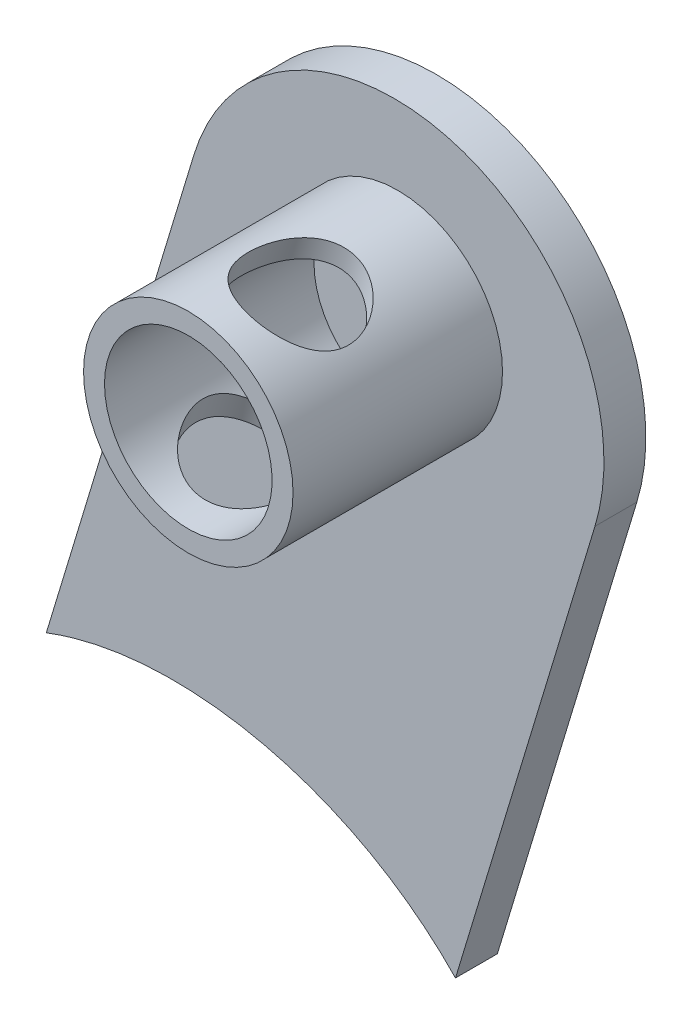
ISO-10303-21;
HEADER;
FILE_DESCRIPTION(('STEP AP214'),'2;1');
FILE_NAME('part.step','',(''),(''),'','','');
FILE_SCHEMA(('AUTOMOTIVE_DESIGN { 1 0 10303 214 1 1 1 1 }'));
ENDSEC;
DATA;
#1=APPLICATION_CONTEXT('core data for automotive mechanical design processes');
#2=APPLICATION_PROTOCOL_DEFINITION('international standard','automotive_design',2000,#1);
#3=PRODUCT_CONTEXT('',#1,'mechanical');
#4=PRODUCT('Part','Part','',(#3));
#5=PRODUCT_RELATED_PRODUCT_CATEGORY('part','',(#4));
#6=PRODUCT_DEFINITION_FORMATION('','',#4);
#7=PRODUCT_DEFINITION_CONTEXT('part definition',#1,'design');
#8=PRODUCT_DEFINITION('design','',#6,#7);
#9=PRODUCT_DEFINITION_SHAPE('','',#8);
#10=(LENGTH_UNIT() NAMED_UNIT(*) SI_UNIT(.MILLI.,.METRE.));
#11=(NAMED_UNIT(*) PLANE_ANGLE_UNIT() SI_UNIT($,.RADIAN.));
#12=(NAMED_UNIT(*) SI_UNIT($,.STERADIAN.) SOLID_ANGLE_UNIT());
#13=UNCERTAINTY_MEASURE_WITH_UNIT(LENGTH_MEASURE(1.E-05),#10,'distance_accuracy_value','');
#14=(GEOMETRIC_REPRESENTATION_CONTEXT(3) GLOBAL_UNCERTAINTY_ASSIGNED_CONTEXT((#13)) GLOBAL_UNIT_ASSIGNED_CONTEXT((#10,
#11,#12)) REPRESENTATION_CONTEXT('',''));
#15=CARTESIAN_POINT('',(0.,0.,0.));
#16=DIRECTION('',(0.,0.,1.));
#17=DIRECTION('',(1.,0.,0.));
#18=AXIS2_PLACEMENT_3D('',#15,#16,#17);
#19=CARTESIAN_POINT('',(1209.34523860419,-251.377000383089,-615.999346088971));
#20=CARTESIAN_POINT('',(1202.97437345163,-275.551616764902,-615.999346088971));
#21=CARTESIAN_POINT('',(1233.28038668328,-283.53832152006,-615.999346088971));
#22=CARTESIAN_POINT('',(1239.65125183585,-259.363705138247,-615.999346088971));
#23=CARTESIAN_POINT('',(1246.02211698841,-235.189088756434,-615.999346088971));
#24=CARTESIAN_POINT('',(1215.71610375676,-227.202384001276,-615.999346088971));
#25=CARTESIAN_POINT('',(1209.34523860419,-251.377000383089,-615.999346088971));
#26=(BOUNDED_CURVE() B_SPLINE_CURVE(3,(#19,#20,#21,#22,#23,#24,#25),.UNSPECIFIED.,.T.,
.F.) B_SPLINE_CURVE_WITH_KNOTS((4,3,4),(0.,0.5,1.),
.UNSPECIFIED.) CURVE() GEOMETRIC_REPRESENTATION_ITEM() RATIONAL_B_SPLINE_CURVE((1.,
0.333333333333333,0.333333333333333,1.,0.333333333333333,0.333333333333333,1.)) REPRESENTATION_ITEM(''));
#27=DIRECTION('',(0.,0.,-1.));
#28=VECTOR('',#27,1.);
#29=SURFACE_OF_LINEAR_EXTRUSION('',#26,#28);
#30=CARTESIAN_POINT('',(1209.34523860419,-251.377000383089,-617.999346088971));
#31=CARTESIAN_POINT('',(1202.97437345163,-275.551616764902,-617.999346088971));
#32=CARTESIAN_POINT('',(1233.28038668328,-283.53832152006,-617.999346088971));
#33=CARTESIAN_POINT('',(1239.65125183585,-259.363705138247,-617.999346088971));
#34=CARTESIAN_POINT('',(1246.02211698841,-235.189088756434,-617.999346088971));
#35=CARTESIAN_POINT('',(1215.71610375676,-227.202384001276,-617.999346088971));
#36=CARTESIAN_POINT('',(1209.34523860419,-251.377000383089,-617.999346088971));
#37=(BOUNDED_CURVE() B_SPLINE_CURVE(3,(#30,#31,#32,#33,#34,#35,#36),.UNSPECIFIED.,.T.,
.F.) B_SPLINE_CURVE_WITH_KNOTS((4,3,4),(0.,0.5,1.),
.UNSPECIFIED.) CURVE() GEOMETRIC_REPRESENTATION_ITEM() RATIONAL_B_SPLINE_CURVE((1.,
0.333333333333333,0.333333333333333,1.,0.333333333333333,0.333333333333333,1.)) REPRESENTATION_ITEM(''));
#38=CARTESIAN_POINT('',(1236.2588408996,-248.221098890482,-617.999346088971));
#39=VERTEX_POINT('',#38);
#40=CARTESIAN_POINT('',(1216.72659095181,-243.715486457987,-617.999346088971));
#41=VERTEX_POINT('',#40);
#42=EDGE_CURVE('E114',#39,#41,#37,.T.);
#43=ORIENTED_EDGE('',*,*,#42,.F.);
#44=DIRECTION('',(0.,0.,-1.));
#45=VECTOR('',#44,1.);
#46=CARTESIAN_POINT('',(1236.2588408996,-248.221098890482,-615.999346088971));
#47=LINE('',#46,#45);
#48=CARTESIAN_POINT('',(1236.2588408996,-248.221098890482,-615.999346088971));
#49=VERTEX_POINT('',#48);
#50=EDGE_CURVE('E113',#49,#39,#47,.T.);
#51=ORIENTED_EDGE('',*,*,#50,.F.);
#52=CARTESIAN_POINT('',(1216.72659095181,-243.715486457987,-615.999346088971));
#53=VERTEX_POINT('',#52);
#54=EDGE_CURVE('E105',#49,#53,#26,.T.);
#55=ORIENTED_EDGE('',*,*,#54,.T.);
#56=DIRECTION('',(0.,0.,-1.));
#57=VECTOR('',#56,1.);
#58=CARTESIAN_POINT('',(1216.72659095181,-243.715486457987,-615.999346088971));
#59=LINE('',#58,#57);
#60=EDGE_CURVE('E52',#53,#41,#59,.T.);
#61=ORIENTED_EDGE('',*,*,#60,.T.);
#62=EDGE_LOOP('',(#43,#51,#55,#61));
#63=FACE_BOUND('',#62,.T.);
#64=ADVANCED_FACE('F37',(#63),#29,.T.);
#65=CARTESIAN_POINT('',(1216.72659095181,-243.715486457987,-615.999346088971));
#66=DIRECTION('',(0.957131671562847,-0.289653177595742,0.));
#67=DIRECTION('',(0.289653177595742,0.957131671562847,0.));
#68=AXIS2_PLACEMENT_3D('',#65,#66,#67);
#69=PLANE('',#68);
#70=DIRECTION('',(0.289653177595742,0.957131671562847,0.));
#71=VECTOR('',#70,1.);
#72=CARTESIAN_POINT('',(1216.72659095181,-243.715486457987,-617.999346088971));
#73=LINE('',#72,#71);
#74=CARTESIAN_POINT('',(1223.77520656495,-220.423999376747,-617.999346088971));
#75=VERTEX_POINT('',#74);
#76=EDGE_CURVE('E118',#41,#75,#73,.T.);
#77=ORIENTED_EDGE('',*,*,#76,.F.);
#78=ORIENTED_EDGE('',*,*,#60,.F.);
#79=DIRECTION('',(0.289653177595742,0.957131671562847,0.));
#80=VECTOR('',#79,1.);
#81=CARTESIAN_POINT('',(1216.72659095181,-243.715486457987,-615.999346088971));
#82=LINE('',#81,#80);
#83=CARTESIAN_POINT('',(1223.77520656495,-220.423999376747,-615.999346088971));
#84=VERTEX_POINT('',#83);
#85=EDGE_CURVE('E86',#53,#84,#82,.T.);
#86=ORIENTED_EDGE('',*,*,#85,.T.);
#87=DIRECTION('',(0.,0.,-1.));
#88=VECTOR('',#87,1.);
#89=CARTESIAN_POINT('',(1223.77520656495,-220.423999376747,-615.999346088971));
#90=LINE('',#89,#88);
#91=EDGE_CURVE('E95',#84,#75,#90,.T.);
#92=ORIENTED_EDGE('',*,*,#91,.T.);
#93=EDGE_LOOP('',(#77,#78,#86,#92));
#94=FACE_BOUND('',#93,.T.);
#95=ADVANCED_FACE('F102',(#94),#69,.F.);
#96=CARTESIAN_POINT('',(1233.34652328058,-223.320531152704,-615.999346088971));
#97=DIRECTION('',(0.,0.,-1.));
#98=DIRECTION('',(1.,0.,0.));
#99=AXIS2_PLACEMENT_3D('',#96,#97,#98);
#100=CYLINDRICAL_SURFACE('',#99,10.0000000000004);
#101=CARTESIAN_POINT('',(1233.34652328058,-223.320531152704,-617.999346088971));
#102=DIRECTION('',(0.,0.,-1.));
#103=DIRECTION('',(1.,0.,0.));
#104=AXIS2_PLACEMENT_3D('',#101,#102,#103);
#105=CIRCLE('',#104,10.0000000000004);
#106=CARTESIAN_POINT('',(1242.91783999621,-226.217062928662,-617.999346088971));
#107=VERTEX_POINT('',#106);
#108=EDGE_CURVE('E97',#75,#107,#105,.T.);
#109=ORIENTED_EDGE('',*,*,#108,.F.);
#110=ORIENTED_EDGE('',*,*,#91,.F.);
#111=CARTESIAN_POINT('',(1233.34652328058,-223.320531152704,-615.999346088971));
#112=DIRECTION('',(0.,0.,-1.));
#113=DIRECTION('',(1.,0.,0.));
#114=AXIS2_PLACEMENT_3D('',#111,#112,#113);
#115=CIRCLE('',#114,10.0000000000004);
#116=CARTESIAN_POINT('',(1242.91783999621,-226.217062928662,-615.999346088971));
#117=VERTEX_POINT('',#116);
#118=EDGE_CURVE('E89',#84,#117,#115,.T.);
#119=ORIENTED_EDGE('',*,*,#118,.T.);
#120=DIRECTION('',(0.,0.,-1.));
#121=VECTOR('',#120,1.);
#122=CARTESIAN_POINT('',(1242.91783999621,-226.217062928662,-615.999346088971));
#123=LINE('',#122,#121);
#124=EDGE_CURVE('E100',#117,#107,#123,.T.);
#125=ORIENTED_EDGE('',*,*,#124,.T.);
#126=EDGE_LOOP('',(#109,#110,#119,#125));
#127=FACE_BOUND('',#126,.T.);
#128=ADVANCED_FACE('F96',(#127),#100,.T.);
#129=CARTESIAN_POINT('',(1236.2588408996,-248.221098890482,-615.999346088971));
#130=DIRECTION('',(-0.957131671562847,0.289653177595743,0.));
#131=DIRECTION('',(-0.289653177595743,-0.957131671562847,0.));
#132=AXIS2_PLACEMENT_3D('',#129,#130,#131);
#133=PLANE('',#132);
#134=DIRECTION('',(-0.289653177595743,-0.957131671562847,0.));
#135=VECTOR('',#134,1.);
#136=CARTESIAN_POINT('',(1236.2588408996,-248.221098890482,-617.999346088971));
#137=LINE('',#136,#135);
#138=EDGE_CURVE('E75',#107,#39,#137,.T.);
#139=ORIENTED_EDGE('',*,*,#138,.F.);
#140=ORIENTED_EDGE('',*,*,#124,.F.);
#141=DIRECTION('',(-0.289653177595743,-0.957131671562847,0.));
#142=VECTOR('',#141,1.);
#143=CARTESIAN_POINT('',(1236.2588408996,-248.221098890482,-615.999346088971));
#144=LINE('',#143,#142);
#145=EDGE_CURVE('E61',#117,#49,#144,.T.);
#146=ORIENTED_EDGE('',*,*,#145,.T.);
#147=ORIENTED_EDGE('',*,*,#50,.T.);
#148=EDGE_LOOP('',(#139,#140,#146,#147));
#149=FACE_BOUND('',#148,.T.);
#150=ADVANCED_FACE('F188',(#149),#133,.F.);
#151=CARTESIAN_POINT('',(1239.65125183585,-259.363705138247,-615.999346088971));
#152=DIRECTION('',(0.,0.,-1.));
#153=DIRECTION('',(1.,0.,0.));
#154=AXIS2_PLACEMENT_3D('',#151,#152,#153);
#155=PLANE('',#154);
#156=CARTESIAN_POINT('',(1233.50419133506,-222.034079566292,-615.999346088971));
#157=DIRECTION('',(0.,0.,1.));
#158=DIRECTION('',(1.,0.,0.));
#159=AXIS2_PLACEMENT_3D('',#156,#157,#158);
#160=CIRCLE('',#159,4.99999999999999);
#161=CARTESIAN_POINT('',(1238.50419133506,-222.034079566292,-615.999346088971));
#162=VERTEX_POINT('',#161);
#163=EDGE_CURVE('E11',#162,#162,#160,.F.);
#164=ORIENTED_EDGE('',*,*,#163,.T.);
#165=EDGE_LOOP('',(#164));
#166=FACE_BOUND('',#165,.T.);
#167=ORIENTED_EDGE('',*,*,#54,.F.);
#168=ORIENTED_EDGE('',*,*,#145,.F.);
#169=ORIENTED_EDGE('',*,*,#118,.F.);
#170=ORIENTED_EDGE('',*,*,#85,.F.);
#171=EDGE_LOOP('',(#167,#168,#169,#170));
#172=FACE_BOUND('',#171,.T.);
#173=ADVANCED_FACE('F91',(#166,#172),#155,.F.);
#174=CARTESIAN_POINT('',(1239.65125183585,-259.363705138247,-617.999346088971));
#175=DIRECTION('',(0.,0.,-1.));
#176=DIRECTION('',(1.,0.,0.));
#177=AXIS2_PLACEMENT_3D('',#174,#175,#176);
#178=PLANE('',#177);
#179=ORIENTED_EDGE('',*,*,#42,.T.);
#180=ORIENTED_EDGE('',*,*,#76,.T.);
#181=ORIENTED_EDGE('',*,*,#108,.T.);
#182=ORIENTED_EDGE('',*,*,#138,.T.);
#183=EDGE_LOOP('',(#179,#180,#181,#182));
#184=FACE_BOUND('',#183,.T.);
#185=ADVANCED_FACE('F146',(#184),#178,.T.);
#186=CARTESIAN_POINT('',(1233.50419133506,-222.034079566292,-605.999346088971));
#187=DIRECTION('',(0.,0.,1.));
#188=DIRECTION('',(-1.,0.,0.));
#189=AXIS2_PLACEMENT_3D('',#186,#187,#188);
#190=PLANE('',#189);
#191=CARTESIAN_POINT('',(1233.50419133506,-222.034079566292,-605.999346088971));
#192=DIRECTION('',(0.,0.,-1.));
#193=DIRECTION('',(-1.,0.,0.));
#194=AXIS2_PLACEMENT_3D('',#191,#192,#193);
#195=CIRCLE('',#194,4.99999999999999);
#196=CARTESIAN_POINT('',(1228.50419133506,-222.034079566292,-605.999346088971));
#197=VERTEX_POINT('',#196);
#198=EDGE_CURVE('E119',#197,#197,#195,.T.);
#199=ORIENTED_EDGE('',*,*,#198,.F.);
#200=EDGE_LOOP('',(#199));
#201=FACE_BOUND('',#200,.T.);
#202=CARTESIAN_POINT('',(1233.50419133506,-222.034079566292,-605.999346088971));
#203=DIRECTION('',(0.,0.,-1.));
#204=DIRECTION('',(-1.,0.,0.));
#205=AXIS2_PLACEMENT_3D('',#202,#203,#204);
#206=CIRCLE('',#205,3.99999999999999);
#207=CARTESIAN_POINT('',(1229.50419133506,-222.034079566292,-605.999346088971));
#208=VERTEX_POINT('',#207);
#209=EDGE_CURVE('E167',#208,#208,#206,.T.);
#210=ORIENTED_EDGE('',*,*,#209,.T.);
#211=EDGE_LOOP('',(#210));
#212=FACE_BOUND('',#211,.T.);
#213=ADVANCED_FACE('F142',(#201,#212),#190,.T.);
#214=CARTESIAN_POINT('',(1233.50419133506,-222.034079566292,-605.999346088971));
#215=DIRECTION('',(0.,0.,-1.));
#216=DIRECTION('',(1.,0.,0.));
#217=AXIS2_PLACEMENT_3D('',#214,#215,#216);
#218=CYLINDRICAL_SURFACE('',#217,4.99999999999999);
#219=CARTESIAN_POINT('',(1229.85712710573,-225.454448334003,-609.999346088971));
#220=CARTESIAN_POINT('',(1229.85713346192,-225.45446363482,-610.129612595847));
#221=CARTESIAN_POINT('',(1229.8652093745,-225.463129956198,-610.260048809647));
#222=CARTESIAN_POINT('',(1229.89726546085,-225.496822810688,-610.5169150605));
#223=CARTESIAN_POINT('',(1229.92127905486,-225.521883720555,-610.643336093028));
#224=CARTESIAN_POINT('',(1229.98436388379,-225.585528822294,-610.887975034532));
#225=CARTESIAN_POINT('',(1230.02335509881,-225.624041051171,-611.006232662533));
#226=CARTESIAN_POINT('',(1230.11564871106,-225.711279430452,-611.232906652065));
#227=CARTESIAN_POINT('',(1230.16895188252,-225.76000613339,-611.341322480766));
#228=CARTESIAN_POINT('',(1230.29423640167,-225.868607456126,-611.555110392888));
#229=CARTESIAN_POINT('',(1230.3673956863,-225.929070064407,-611.65949392346));
#230=CARTESIAN_POINT('',(1230.52914639338,-226.053974070613,-611.852867064684));
#231=CARTESIAN_POINT('',(1230.61774546957,-226.118417431579,-611.941848996726));
#232=CARTESIAN_POINT('',(1230.81605656543,-226.251796173768,-612.107763965456));
#233=CARTESIAN_POINT('',(1230.92678917981,-226.320741535936,-612.18348050825));
#234=CARTESIAN_POINT('',(1231.16312868173,-226.454236992392,-612.312198222455));
#235=CARTESIAN_POINT('',(1231.28872611808,-226.518789838794,-612.365213729409));
#236=CARTESIAN_POINT('',(1231.54228809192,-226.635055746977,-612.443107742135));
#237=CARTESIAN_POINT('',(1231.6694483061,-226.687355588234,-612.469719904836));
#238=CARTESIAN_POINT('',(1231.93007799565,-226.781851268447,-612.499761385682));
#239=CARTESIAN_POINT('',(1232.06354360422,-226.824053206065,-612.503204730966));
#240=CARTESIAN_POINT('',(1232.32045224235,-226.893599835504,-612.487479404039));
#241=CARTESIAN_POINT('',(1232.44375755329,-226.921917386082,-612.470251050166));
#242=CARTESIAN_POINT('',(1232.68819163269,-226.968614035379,-612.41714397921));
#243=CARTESIAN_POINT('',(1232.80932023757,-226.986992390199,-612.381263866531));
#244=CARTESIAN_POINT('',(1233.04775419072,-227.014670277677,-612.291639673746));
#245=CARTESIAN_POINT('',(1233.16498345622,-227.023840682919,-612.23765530604));
#246=CARTESIAN_POINT('',(1233.39101547488,-227.03408065739,-612.113687548467));
#247=CARTESIAN_POINT('',(1233.49981519252,-227.03514732171,-612.043698430715));
#248=CARTESIAN_POINT('',(1233.71638966128,-227.030856834818,-611.882107710138));
#249=CARTESIAN_POINT('',(1233.82309535293,-227.024882925958,-611.789088518156));
#250=CARTESIAN_POINT('',(1234.02079621302,-227.008311326233,-611.587871776645));
#251=CARTESIAN_POINT('',(1234.11177928799,-226.997710098042,-611.479662658285));
#252=CARTESIAN_POINT('',(1234.28028589007,-226.974258955158,-611.24272560791));
#253=CARTESIAN_POINT('',(1234.35658777301,-226.961308992198,-611.113131031335));
#254=CARTESIAN_POINT('',(1234.4842000931,-226.937531251406,-610.842001910573));
#255=CARTESIAN_POINT('',(1234.5355366062,-226.926701266385,-610.700480006427));
#256=CARTESIAN_POINT('',(1234.60675453659,-226.911127279723,-610.421309810764));
#257=CARTESIAN_POINT('',(1234.62880624595,-226.905969001428,-610.284243291362));
#258=CARTESIAN_POINT('',(1234.64704642204,-226.901727069698,-610.008342735179));
#259=CARTESIAN_POINT('',(1234.64325315813,-226.902639125242,-609.869510016171));
#260=CARTESIAN_POINT('',(1234.61199393971,-226.909831875773,-609.610211292524));
#261=CARTESIAN_POINT('',(1234.58716295615,-226.915514375916,-609.489397461201));
#262=CARTESIAN_POINT('',(1234.51875100043,-226.930188543718,-609.253426623293));
#263=CARTESIAN_POINT('',(1234.4751639562,-226.939181282895,-609.138271462104));
#264=CARTESIAN_POINT('',(1234.36884039314,-226.95905910591,-608.910817761714));
#265=CARTESIAN_POINT('',(1234.30531046076,-226.970012543783,-608.798898546838));
#266=CARTESIAN_POINT('',(1234.16230266122,-226.991106029033,-608.585672910122));
#267=CARTESIAN_POINT('',(1234.08281660271,-227.001245654868,-608.484371980182));
#268=CARTESIAN_POINT('',(1233.89920140789,-227.01940815373,-608.281899170167));
#269=CARTESIAN_POINT('',(1233.79322891156,-227.027003082793,-608.182353212198));
#270=CARTESIAN_POINT('',(1233.5668657874,-227.034969068679,-608.000815493965));
#271=CARTESIAN_POINT('',(1233.44647031062,-227.03533768915,-607.918829663312));
#272=CARTESIAN_POINT('',(1233.19120177457,-227.025948254243,-607.77291177418));
#273=CARTESIAN_POINT('',(1233.05603048412,-227.015922680379,-607.709513293762));
#274=CARTESIAN_POINT('',(1232.77838730831,-226.983087703896,-607.606501329009));
#275=CARTESIAN_POINT('',(1232.63592195328,-226.96028956076,-607.566866959366));
#276=CARTESIAN_POINT('',(1232.36217381874,-226.903732134007,-607.515924679614));
#277=CARTESIAN_POINT('',(1232.23106436162,-226.871170493164,-607.50235140314));
#278=CARTESIAN_POINT('',(1231.97156988355,-226.79531014858,-607.497237921476));
#279=CARTESIAN_POINT('',(1231.84318392473,-226.752015208297,-607.50569000331));
#280=CARTESIAN_POINT('',(1231.6014861362,-226.659592173923,-607.542887119366));
#281=CARTESIAN_POINT('',(1231.48773846698,-226.611036442564,-607.570258260607));
#282=CARTESIAN_POINT('',(1231.26880790762,-226.508193793462,-607.642663538729));
#283=CARTESIAN_POINT('',(1231.16362624834,-226.453906054645,-607.687700208604));
#284=CARTESIAN_POINT('',(1230.95940622812,-226.339697379735,-607.79616390771));
#285=CARTESIAN_POINT('',(1230.86082302766,-226.279634818516,-607.860295113661));
#286=CARTESIAN_POINT('',(1230.67623342783,-226.158983648785,-608.004240199118));
#287=CARTESIAN_POINT('',(1230.59023283669,-226.098394810926,-608.084061281598));
#288=CARTESIAN_POINT('',(1230.42366610614,-225.973904593847,-608.26634188342));
#289=CARTESIAN_POINT('',(1230.3444925776,-225.910273638088,-608.370263814971));
#290=CARTESIAN_POINT('',(1230.20296444973,-225.79047613363,-608.592961374353));
#291=CARTESIAN_POINT('',(1230.14062472418,-225.734316208159,-608.71175000317));
#292=CARTESIAN_POINT('',(1230.03193996236,-225.632582559198,-608.965982206635));
#293=CARTESIAN_POINT('',(1229.98616264614,-225.58739946563,-609.101833477395));
#294=CARTESIAN_POINT('',(1229.93258494056,-225.53325913042,-609.312568738491));
#295=CARTESIAN_POINT('',(1229.91724749325,-225.517492856105,-609.383905864668));
#296=CARTESIAN_POINT('',(1229.89167859121,-225.490970655211,-609.52838678582));
#297=CARTESIAN_POINT('',(1229.88144356648,-225.480211225855,-609.601529279925));
#298=CARTESIAN_POINT('',(1229.86826218803,-225.466292146944,-609.728847075518));
#299=CARTESIAN_POINT('',(1229.86408991231,-225.461860741917,-609.782762410483));
#300=CARTESIAN_POINT('',(1229.85852095498,-225.45593555159,-609.890890705281));
#301=CARTESIAN_POINT('',(1229.85712445904,-225.45444196281,-609.945103684781));
#302=CARTESIAN_POINT('',(1229.85712710573,-225.454448334003,-609.999346088971));
#303=B_SPLINE_CURVE_WITH_KNOTS('',3,(#219,#220,#221,#222,#223,#224,#225,#226,#227,#228,#229,
#230,#231,#232,#233,#234,#235,#236,#237,#238,#239,#240,#241,#242,#243,#244,#245,#246,#247,#248,
#249,#250,#251,#252,#253,#254,#255,#256,#257,#258,#259,#260,#261,#262,#263,#264,#265,#266,#267,
#268,#269,#270,#271,#272,#273,#274,#275,#276,#277,#278,#279,#280,#281,#282,#283,#284,#285,#286,
#287,#288,#289,#290,#291,#292,#293,#294,#295,#296,#297,#298,#299,#300,#301,#302),.UNSPECIFIED.,
.T.,.F.,(4,2,2,2,2,2,2,2,2,2,2,2,2,2,2,2,2,2,2,2,2,2,2,2,2,2,2,2,2,2,2,2,2,2,2,2,2,2,2,2,2,4),
(0.,0.390580306486961,0.781982232062044,1.17132148982686,1.56068181366368,1.98215578129642,
2.40383927716021,2.85394730601997,3.30377067414797,3.72158712424921,4.13915059220192,
4.52040243716431,4.90168281298729,5.28823836832947,5.67493248380769,6.09817978647322,
6.52175120619908,6.97222104328716,7.4222193553435,7.83655727140615,8.25060232976027,
8.61935458565149,8.98822631095238,9.37418241020294,9.76033715555214,10.1951685895663,
10.6301466245059,11.0766045353749,11.5226694952702,11.9278067597883,12.3328021699002,
12.7111106218385,13.0894733378514,13.484018768038,13.878745752569,14.3127560463027,
14.7471485711798,15.1952687260161,15.418924415395,15.6424233996907,15.8050484542807,
15.967684387038),.UNSPECIFIED.);
#304=CARTESIAN_POINT('',(1229.85712710573,-225.454448334003,-609.999346088971));
#305=VERTEX_POINT('',#304);
#306=EDGE_CURVE('E160',#305,#305,#303,.T.);
#307=ORIENTED_EDGE('',*,*,#306,.F.);
#308=EDGE_LOOP('',(#307));
#309=FACE_BOUND('',#308,.T.);
#310=CARTESIAN_POINT('',(1232.36559720658,-217.165444910602,-609.999346088971));
#311=CARTESIAN_POINT('',(1232.36561098009,-217.16543570156,-609.869079582094));
#312=CARTESIAN_POINT('',(1232.37713700782,-217.162701442056,-609.738643368294));
#313=CARTESIAN_POINT('',(1232.42249590927,-217.152436395753,-609.481777117441));
#314=CARTESIAN_POINT('',(1232.45637565634,-217.144895531147,-609.355356084913));
#315=CARTESIAN_POINT('',(1232.54416443791,-217.126908745808,-609.11071714341));
#316=CARTESIAN_POINT('',(1232.59796697818,-217.116478343997,-608.992459515408));
#317=CARTESIAN_POINT('',(1232.72314519243,-217.095052650113,-608.765785525876));
#318=CARTESIAN_POINT('',(1232.79452181709,-217.084057327507,-608.657369697175));
#319=CARTESIAN_POINT('',(1232.95900029628,-217.063145897093,-608.443581785054));
#320=CARTESIAN_POINT('',(1233.0534084558,-217.053393597645,-608.339198254481));
#321=CARTESIAN_POINT('',(1233.25727356121,-217.039134537182,-608.145825113257));
#322=CARTESIAN_POINT('',(1233.366737965,-217.034630386302,-608.056843181216));
#323=CARTESIAN_POINT('',(1233.60572770947,-217.033590361688,-607.890928212485));
#324=CARTESIAN_POINT('',(1233.73610792532,-217.037612073448,-607.815211669691));
#325=CARTESIAN_POINT('',(1234.006809703,-217.05756062284,-607.686493955487));
#326=CARTESIAN_POINT('',(1234.1471249255,-217.073479929735,-607.633478448532));
#327=CARTESIAN_POINT('',(1234.42260597,-217.117316331297,-607.555584435807));
#328=CARTESIAN_POINT('',(1234.55742778555,-217.144299131746,-607.528972273106));
#329=CARTESIAN_POINT('',(1234.82671960585,-217.210171615878,-607.498930792259));
#330=CARTESIAN_POINT('',(1234.96118977421,-217.249054080214,-607.495487446975));
#331=CARTESIAN_POINT('',(1235.21355136625,-217.333625995595,-607.511212773902));
#332=CARTESIAN_POINT('',(1235.33186760361,-217.37842947039,-607.528441127775));
#333=CARTESIAN_POINT('',(1235.56117815732,-217.475100387357,-607.581548198731));
#334=CARTESIAN_POINT('',(1235.67217192506,-217.526968357907,-607.617428311411));
#335=CARTESIAN_POINT('',(1235.8859437816,-217.636139823131,-607.707052504196));
#336=CARTESIAN_POINT('',(1235.98858695657,-217.693508592111,-607.761036871901));
#337=CARTESIAN_POINT('',(1236.182369055,-217.810315393574,-607.885004629474));
#338=CARTESIAN_POINT('',(1236.27350384159,-217.869754160408,-607.954993747226));
#339=CARTESIAN_POINT('',(1236.45135860673,-217.993409290987,-608.116584467803));
#340=CARTESIAN_POINT('',(1236.53684693662,-218.057546157681,-608.209603659786));
#341=CARTESIAN_POINT('',(1236.69218550664,-218.180956759589,-608.410820401296));
#342=CARTESIAN_POINT('',(1236.76202372119,-218.240226733072,-608.519029519656));
#343=CARTESIAN_POINT('',(1236.88925225195,-218.353175093004,-608.755966570031));
#344=CARTESIAN_POINT('',(1236.94557043931,-218.406259371773,-608.885561146606));
#345=CARTESIAN_POINT('',(1237.03858557425,-218.496804774017,-609.156690267368));
#346=CARTESIAN_POINT('',(1237.07530299846,-218.534282192719,-609.298212171515));
#347=CARTESIAN_POINT('',(1237.1259353611,-218.586731277776,-609.577382367178));
#348=CARTESIAN_POINT('',(1237.14142671609,-218.603251073204,-609.714448886579));
#349=CARTESIAN_POINT('',(1237.15425419413,-218.616894892896,-609.990349442762));
#350=CARTESIAN_POINT('',(1237.15160314172,-218.614032618008,-610.12918216177));
#351=CARTESIAN_POINT('',(1237.12957733742,-218.590714420368,-610.388480885417));
#352=CARTESIAN_POINT('',(1237.11206373125,-218.572217335425,-610.50929471674));
#353=CARTESIAN_POINT('',(1237.06326758178,-218.522072917167,-610.745265554648));
#354=CARTESIAN_POINT('',(1237.03198057941,-218.490421325338,-610.860420715837));
#355=CARTESIAN_POINT('',(1236.9545195952,-218.414925472229,-611.087874416227));
#356=CARTESIAN_POINT('',(1236.9077232334,-218.370584400628,-611.199793631103));
#357=CARTESIAN_POINT('',(1236.80040760277,-218.273736472043,-611.413019267819));
#358=CARTESIAN_POINT('',(1236.73988128334,-218.221225423993,-611.514320197759));
#359=CARTESIAN_POINT('',(1236.59714694293,-218.104300985999,-611.716793007774));
#360=CARTESIAN_POINT('',(1236.51316759076,-218.039221639545,-611.816338965743));
#361=CARTESIAN_POINT('',(1236.32920464928,-217.907080211246,-611.997876683977));
#362=CARTESIAN_POINT('',(1236.22921567377,-217.84001746833,-612.079862514629));
#363=CARTESIAN_POINT('',(1236.01157448572,-217.70629200236,-612.225780403762));
#364=CARTESIAN_POINT('',(1235.89352575294,-217.639686547772,-612.289178884179));
#365=CARTESIAN_POINT('',(1235.64426443617,-217.513066388559,-612.392190848933));
#366=CARTESIAN_POINT('',(1235.51306352982,-217.453045934666,-612.431825218576));
#367=CARTESIAN_POINT('',(1235.25389022911,-217.348327340875,-612.482767498327));
#368=CARTESIAN_POINT('',(1235.12672613395,-217.302728622668,-612.496340774801));
#369=CARTESIAN_POINT('',(1234.86871181937,-217.221977217082,-612.501454256465));
#370=CARTESIAN_POINT('',(1234.7378629062,-217.18682087773,-612.493002174632));
#371=CARTESIAN_POINT('',(1234.4854754782,-217.12972075116,-612.455805058575));
#372=CARTESIAN_POINT('',(1234.36389161622,-217.107058981495,-612.428433917334));
#373=CARTESIAN_POINT('',(1234.12467373413,-217.071253881474,-612.356028639212));
#374=CARTESIAN_POINT('',(1234.00704028309,-217.058111916898,-612.310991969337));
#375=CARTESIAN_POINT('',(1233.7737623939,-217.039922235953,-612.202528270231));
#376=CARTESIAN_POINT('',(1233.65841821399,-217.035244754251,-612.138397064281));
#377=CARTESIAN_POINT('',(1233.43790461539,-217.033301058336,-611.994451978823));
#378=CARTESIAN_POINT('',(1233.33273990314,-217.036038255488,-611.914630896344));
#379=CARTESIAN_POINT('',(1233.1250963277,-217.047282607407,-611.732350294521));
#380=CARTESIAN_POINT('',(1233.02392634051,-217.056336879579,-611.62842836297));
#381=CARTESIAN_POINT('',(1232.83972192204,-217.077559161947,-611.405730803589));
#382=CARTESIAN_POINT('',(1232.75670354114,-217.089729907377,-611.286942174772));
#383=CARTESIAN_POINT('',(1232.60984735039,-217.114130153718,-611.032709971306));
#384=CARTESIAN_POINT('',(1232.54669859188,-217.12634935673,-610.896858700546));
#385=CARTESIAN_POINT('',(1232.47209178935,-217.141697693728,-610.686123439451));
#386=CARTESIAN_POINT('',(1232.450585969,-217.146314227762,-610.614786313273));
#387=CARTESIAN_POINT('',(1232.41460164572,-217.154208806321,-610.470305392121));
#388=CARTESIAN_POINT('',(1232.40011822965,-217.157487786396,-610.397162898016));
#389=CARTESIAN_POINT('',(1232.38143091325,-217.161762561391,-610.269845102424));
#390=CARTESIAN_POINT('',(1232.37550164471,-217.163136973862,-610.215929767458));
#391=CARTESIAN_POINT('',(1232.36758179201,-217.164980096065,-610.10780147266));
#392=CARTESIAN_POINT('',(1232.36559147135,-217.165448745207,-610.05358849316));
#393=CARTESIAN_POINT('',(1232.36559720658,-217.165444910602,-609.999346088971));
#394=B_SPLINE_CURVE_WITH_KNOTS('',3,(#310,#311,#312,#313,#314,#315,#316,#317,#318,#319,#320,
#321,#322,#323,#324,#325,#326,#327,#328,#329,#330,#331,#332,#333,#334,#335,#336,#337,#338,#339,
#340,#341,#342,#343,#344,#345,#346,#347,#348,#349,#350,#351,#352,#353,#354,#355,#356,#357,#358,
#359,#360,#361,#362,#363,#364,#365,#366,#367,#368,#369,#370,#371,#372,#373,#374,#375,#376,#377,
#378,#379,#380,#381,#382,#383,#384,#385,#386,#387,#388,#389,#390,#391,#392,#393),.UNSPECIFIED.,
.T.,.F.,(4,2,2,2,2,2,2,2,2,2,2,2,2,2,2,2,2,2,2,2,2,2,2,2,2,2,2,2,2,2,2,2,2,2,2,2,2,2,2,2,2,4),
(0.,0.39058030648694,0.781982232062027,1.17132148982693,1.56068181366372,1.98215578129652,
2.4038392771603,2.85394730602007,3.30377067414811,3.72158712424921,4.13915059220189,
4.52040243716431,4.90168281298725,5.28823836832958,5.67493248380769,6.09817978647315,
6.52175120619882,6.97222104328699,7.42221935534348,7.83655727140601,8.25060232976025,
8.61935458565136,8.98822631095232,9.37418241020297,9.7603371555521,10.1951685895661,
10.6301466245058,11.0766045353751,11.5226694952702,11.927806759788,12.3328021699002,
12.7111106218384,13.0894733378513,13.4840187680378,13.8787457525687,14.3127560463023,
14.7471485711798,15.1952687260161,15.418924415395,15.6424233996908,15.8050484542808,
15.9676843870379),.UNSPECIFIED.);
#395=CARTESIAN_POINT('',(1232.36559720658,-217.165444910602,-609.999346088971));
#396=VERTEX_POINT('',#395);
#397=EDGE_CURVE('E155',#396,#396,#394,.T.);
#398=ORIENTED_EDGE('',*,*,#397,.F.);
#399=EDGE_LOOP('',(#398));
#400=FACE_BOUND('',#399,.T.);
#401=ORIENTED_EDGE('',*,*,#198,.T.);
#402=EDGE_LOOP('',(#401));
#403=FACE_BOUND('',#402,.T.);
#404=ORIENTED_EDGE('',*,*,#163,.F.);
#405=EDGE_LOOP('',(#404));
#406=FACE_BOUND('',#405,.T.);
#407=ADVANCED_FACE('F140',(#309,#400,#403,#406),#218,.T.);
#408=CARTESIAN_POINT('',(1233.50419133506,-222.034079566292,-605.999346088971));
#409=DIRECTION('',(0.,0.,-1.));
#410=DIRECTION('',(1.,0.,0.));
#411=AXIS2_PLACEMENT_3D('',#408,#409,#410);
#412=CYLINDRICAL_SURFACE('',#411,3.99999999999999);
#413=CARTESIAN_POINT('',(1230.206920399,-224.29858930886,-609.999346088971));
#414=CARTESIAN_POINT('',(1230.20692069735,-224.298590356546,-610.061502840416));
#415=CARTESIAN_POINT('',(1230.20860447962,-224.301048434926,-610.123672035642));
#416=CARTESIAN_POINT('',(1230.21531749797,-224.310774130174,-610.247463268519));
#417=CARTESIAN_POINT('',(1230.22034870448,-224.318044579771,-610.309084962228));
#418=CARTESIAN_POINT('',(1230.24043083985,-224.346750855939,-610.492572136714));
#419=CARTESIAN_POINT('',(1230.26047013837,-224.375080577361,-610.61289442016));
#420=CARTESIAN_POINT('',(1230.31296869097,-224.44613006772,-610.844944286849));
#421=CARTESIAN_POINT('',(1230.34532039666,-224.488724855661,-610.956736504026));
#422=CARTESIAN_POINT('',(1230.42194765658,-224.584280761978,-611.171354614305));
#423=CARTESIAN_POINT('',(1230.46622353608,-224.637242163113,-611.274180262724));
#424=CARTESIAN_POINT('',(1230.57323422555,-224.757457434247,-611.483080070274));
#425=CARTESIAN_POINT('',(1230.6376485376,-224.825675534225,-611.587739413975));
#426=CARTESIAN_POINT('',(1230.78155054274,-224.966208511313,-611.783107640594));
#427=CARTESIAN_POINT('',(1230.86105123579,-225.038526883664,-611.873804368924));
#428=CARTESIAN_POINT('',(1231.04577327619,-225.19195923416,-612.049566387143));
#429=CARTESIAN_POINT('',(1231.15294051556,-225.273081783782,-612.132632273421));
#430=CARTESIAN_POINT('',(1231.32705310245,-225.390417682239,-612.239891243707));
#431=CARTESIAN_POINT('',(1231.3873368832,-225.428815430716,-612.272761227304));
#432=CARTESIAN_POINT('',(1231.51210700244,-225.503498572508,-612.332300774334));
#433=CARTESIAN_POINT('',(1231.57659039882,-225.539785411626,-612.358974620009));
#434=CARTESIAN_POINT('',(1231.70263044642,-225.606043441992,-612.403329904227));
#435=CARTESIAN_POINT('',(1231.76382324832,-225.636282184561,-612.421648065489));
#436=CARTESIAN_POINT('',(1231.88882578006,-225.694042722028,-612.452648375284));
#437=CARTESIAN_POINT('',(1231.95263397551,-225.721566078591,-612.465333778187));
#438=CARTESIAN_POINT('',(1232.08234051427,-225.773493067461,-612.484859886605));
#439=CARTESIAN_POINT('',(1232.1482375392,-225.79789862052,-612.491704205484));
#440=CARTESIAN_POINT('',(1232.28151781843,-225.843283764409,-612.49944530236));
#441=CARTESIAN_POINT('',(1232.34890090076,-225.864263749305,-612.500342764934));
#442=CARTESIAN_POINT('',(1232.53407556546,-225.91656281421,-612.494620715423));
#443=CARTESIAN_POINT('',(1232.65277880593,-225.944258463993,-612.482039585892));
#444=CARTESIAN_POINT('',(1232.88909655975,-225.988336842501,-612.439615871004));
#445=CARTESIAN_POINT('',(1233.00671099013,-226.00471871597,-612.409771980997));
#446=CARTESIAN_POINT('',(1233.23801715175,-226.026908998931,-612.334137529687));
#447=CARTESIAN_POINT('',(1233.35169802105,-226.03269011754,-612.2883061694));
#448=CARTESIAN_POINT('',(1233.57226344958,-226.035023569675,-612.182408849986));
#449=CARTESIAN_POINT('',(1233.6791464534,-226.031573798835,-612.122339647907));
#450=CARTESIAN_POINT('',(1233.89695569771,-226.016425957498,-611.981289672047));
#451=CARTESIAN_POINT('',(1234.0067298087,-226.003754839249,-611.89863681228));
#452=CARTESIAN_POINT('',(1234.21310507505,-225.972146299241,-611.719081351763));
#453=CARTESIAN_POINT('',(1234.30968668685,-225.953199720118,-611.622158042587));
#454=CARTESIAN_POINT('',(1234.49893317155,-225.909783483197,-611.401934835797));
#455=CARTESIAN_POINT('',(1234.58943949034,-225.884915676964,-611.276843325613));
#456=CARTESIAN_POINT('',(1234.74637918388,-225.83719939573,-611.012053851669));
#457=CARTESIAN_POINT('',(1234.8128568839,-225.81434726195,-610.872383401517));
#458=CARTESIAN_POINT('',(1234.90300457215,-225.781743902219,-610.619807282864));
#459=CARTESIAN_POINT('',(1234.93333493045,-225.770127777747,-610.509524163757));
#460=CARTESIAN_POINT('',(1234.97616311435,-225.753467594674,-610.28511571141));
#461=CARTESIAN_POINT('',(1234.9886853021,-225.748414558377,-610.170995846314));
#462=CARTESIAN_POINT('',(1234.99492158492,-225.745917268116,-609.941888728468));
#463=CARTESIAN_POINT('',(1234.98859257849,-225.748490450725,-609.826900088492));
#464=CARTESIAN_POINT('',(1234.95757319164,-225.760732478692,-609.599784924652));
#465=CARTESIAN_POINT('',(1234.93286760546,-225.770407200154,-609.487660850599));
#466=CARTESIAN_POINT('',(1234.86743614302,-225.794763185254,-609.270909329545));
#467=CARTESIAN_POINT('',(1234.82698106569,-225.80935928987,-609.166188773076));
#468=CARTESIAN_POINT('',(1234.73211425182,-225.841270746812,-608.963771389077));
#469=CARTESIAN_POINT('',(1234.67769756199,-225.858587063367,-608.866077070093));
#470=CARTESIAN_POINT('',(1234.5452315612,-225.89695938963,-608.660734147307));
#471=CARTESIAN_POINT('',(1234.4646553555,-225.918099716148,-608.554731561669));
#472=CARTESIAN_POINT('',(1234.28879976705,-225.9574099389,-608.354975428316));
#473=CARTESIAN_POINT('',(1234.19350514114,-225.975576714929,-608.261234767728));
#474=CARTESIAN_POINT('',(1233.97398837476,-226.008183039181,-608.073382018329));
#475=CARTESIAN_POINT('',(1233.84757782745,-226.021558448131,-607.981618690485));
#476=CARTESIAN_POINT('',(1233.58101165395,-226.035557207504,-607.819199074251));
#477=CARTESIAN_POINT('',(1233.44086251058,-226.036186543579,-607.748532893844));
#478=CARTESIAN_POINT('',(1233.2282711233,-226.025138072026,-607.662765020996));
#479=CARTESIAN_POINT('',(1233.15924665829,-226.019796832362,-607.638048645019));
#480=CARTESIAN_POINT('',(1233.01980243011,-226.005259046195,-607.594407812238));
#481=CARTESIAN_POINT('',(1232.94938349985,-225.996064738649,-607.57548000282));
#482=CARTESIAN_POINT('',(1232.80786960331,-225.973655938277,-607.543740258831));
#483=CARTESIAN_POINT('',(1232.73677528219,-225.960444968765,-607.530922989454));
#484=CARTESIAN_POINT('',(1232.59462372554,-225.92997252009,-607.511606916678));
#485=CARTESIAN_POINT('',(1232.52356648583,-225.912711711573,-607.50510706804));
#486=CARTESIAN_POINT('',(1232.33247561484,-225.860641931893,-607.496274573464));
#487=CARTESIAN_POINT('',(1232.21311547244,-225.822025303364,-607.500080296061));
#488=CARTESIAN_POINT('',(1231.98042811315,-225.734570309921,-607.526263678516));
#489=CARTESIAN_POINT('',(1231.86710062276,-225.685732408905,-607.54864049565));
#490=CARTESIAN_POINT('',(1231.65311485778,-225.581920214675,-607.609668504517));
#491=CARTESIAN_POINT('',(1231.55215345315,-225.527217589617,-607.647728162535));
#492=CARTESIAN_POINT('',(1231.36019320149,-225.412803660813,-607.738465551414));
#493=CARTESIAN_POINT('',(1231.26919603889,-225.353091513224,-607.791145748538));
#494=CARTESIAN_POINT('',(1231.0891349917,-225.224840133688,-607.915667367691));
#495=CARTESIAN_POINT('',(1231.00125210961,-225.156027995589,-607.988930079728));
#496=CARTESIAN_POINT('',(1230.8389959459,-225.018716488612,-608.149499321485));
#497=CARTESIAN_POINT('',(1230.76463811212,-224.950217563414,-608.236821697805));
#498=CARTESIAN_POINT('',(1230.61976466867,-224.807496235703,-608.437578604033));
#499=CARTESIAN_POINT('',(1230.5513477912,-224.733872024969,-608.552962701542));
#500=CARTESIAN_POINT('',(1230.4323956163,-224.597719613539,-608.798635498731));
#501=CARTESIAN_POINT('',(1230.38185042671,-224.535185284057,-608.928915900124));
#502=CARTESIAN_POINT('',(1230.30829035754,-224.44011479927,-609.172151389756));
#503=CARTESIAN_POINT('',(1230.2816657513,-224.404005967813,-609.282616661125));
#504=CARTESIAN_POINT('',(1230.24019330945,-224.346568272936,-609.509285431973));
#505=CARTESIAN_POINT('',(1230.22530818835,-224.325192643255,-609.625469508771));
#506=CARTESIAN_POINT('',(1230.21330848141,-224.30786693057,-609.785406083617));
#507=CARTESIAN_POINT('',(1230.21091529473,-224.304396324004,-609.828071614679));
#508=CARTESIAN_POINT('',(1230.20772095045,-224.299756862399,-609.913604787922));
#509=CARTESIAN_POINT('',(1230.20692019321,-224.298588586201,-609.956472478214));
#510=CARTESIAN_POINT('',(1230.206920399,-224.29858930886,-609.999346088971));
#511=B_SPLINE_CURVE_WITH_KNOTS('',3,(#413,#414,#415,#416,#417,#418,#419,#420,#421,#422,#423,
#424,#425,#426,#427,#428,#429,#430,#431,#432,#433,#434,#435,#436,#437,#438,#439,#440,#441,#442,
#443,#444,#445,#446,#447,#448,#449,#450,#451,#452,#453,#454,#455,#456,#457,#458,#459,#460,#461,
#462,#463,#464,#465,#466,#467,#468,#469,#470,#471,#472,#473,#474,#475,#476,#477,#478,#479,#480,
#481,#482,#483,#484,#485,#486,#487,#488,#489,#490,#491,#492,#493,#494,#495,#496,#497,#498,#499,
#500,#501,#502,#503,#504,#505,#506,#507,#508,#509,#510),.UNSPECIFIED.,.T.,.F.,(4,2,2,2,2,2,2,2,
2,2,2,2,2,2,2,2,2,2,2,2,2,2,2,2,2,2,2,2,2,2,2,2,2,2,2,2,2,2,2,2,2,2,2,2,2,2,2,2,4),(0.,
0.186415315858525,0.372940459994571,0.746478880764758,1.11682668423136,1.48718459072622,
1.90722798685084,2.32763499192889,2.79876029265969,3.03445880867335,3.26999394209529,
3.48170145743217,3.69328649746518,3.90474055342615,4.11617026725896,4.4818470970814,
4.84755156693946,5.21419620193019,5.58092442797455,5.99329080205328,6.40626158573471,
6.87316206383519,7.33919680735502,7.68265621505495,8.02564530559534,8.36941921026446,
8.71347788865116,9.05186495232124,9.39037223519224,9.79332737765212,10.1967026751548,
10.6647326786677,11.1325428866822,11.3527929661043,11.5729152387448,11.7928449800805,
12.0127383271004,12.3871595324237,12.7615637480926,13.1229788842096,13.4844550226791,
13.8834503840963,14.2828986410987,14.7399238503464,15.1966956936291,15.5530255473297,
15.9082190611889,16.0367696833384,16.1653526209168),.UNSPECIFIED.);
#512=CARTESIAN_POINT('',(1230.206920399,-224.29858930886,-609.999346088971));
#513=VERTEX_POINT('',#512);
#514=EDGE_CURVE('E41',#513,#513,#511,.T.);
#515=ORIENTED_EDGE('',*,*,#514,.T.);
#516=EDGE_LOOP('',(#515));
#517=FACE_BOUND('',#516,.T.);
#518=CARTESIAN_POINT('',(1232.01580391331,-218.321303935746,-609.999346088971));
#519=CARTESIAN_POINT('',(1232.01580474252,-218.321303229287,-609.937189337525));
#520=CARTESIAN_POINT('',(1232.01856892638,-218.320191222259,-609.8750201423));
#521=CARTESIAN_POINT('',(1232.02954814434,-218.315819662311,-609.751228909423));
#522=CARTESIAN_POINT('',(1232.0377663889,-218.312558844532,-609.689607215714));
#523=CARTESIAN_POINT('',(1232.07039562316,-218.299804412985,-609.506120041227));
#524=CARTESIAN_POINT('',(1232.10278041927,-218.287339599227,-609.385797757782));
#525=CARTESIAN_POINT('',(1232.1858648093,-218.257321067645,-609.153747891092));
#526=CARTESIAN_POINT('',(1232.23640560271,-218.239811726645,-609.041955673916));
#527=CARTESIAN_POINT('',(1232.35315808575,-218.202777608603,-608.827337563637));
#528=CARTESIAN_POINT('',(1232.41937020285,-218.183252776592,-608.724511915218));
#529=CARTESIAN_POINT('',(1232.57508077764,-218.14254385895,-608.515612107667));
#530=CARTESIAN_POINT('',(1232.66651155939,-218.121488576767,-608.410952763966));
#531=CARTESIAN_POINT('',(1232.86418877197,-218.084326440655,-608.215584537347));
#532=CARTESIAN_POINT('',(1232.97044795939,-218.068223886091,-608.124887809017));
#533=CARTESIAN_POINT('',(1233.20924803726,-218.042960450052,-607.949125790798));
#534=CARTESIAN_POINT('',(1233.34341305572,-218.034871378913,-607.86605990452));
#535=CARTESIAN_POINT('',(1233.55336943581,-218.033764835316,-607.758800934235));
#536=CARTESIAN_POINT('',(1233.62482821721,-218.035235845633,-607.725930950638));
#537=CARTESIAN_POINT('',(1233.7700719145,-218.042265975147,-607.666391403607));
#538=CARTESIAN_POINT('',(1233.84385518362,-218.047822259821,-607.639717557932));
#539=CARTESIAN_POINT('',(1233.98548422566,-218.062567924832,-607.595362273714));
#540=CARTESIAN_POINT('',(1234.05317555226,-218.071332903975,-607.577044112453));
#541=CARTESIAN_POINT('',(1234.18922954567,-218.092574926231,-607.546043802657));
#542=CARTESIAN_POINT('',(1234.25759180145,-218.105049818937,-607.533358399754));
#543=CARTESIAN_POINT('',(1234.3943259372,-218.133754774768,-607.513832291336));
#544=CARTESIAN_POINT('',(1234.46269778502,-218.149982508433,-607.506987972457));
#545=CARTESIAN_POINT('',(1234.59877872212,-218.18611314189,-607.499246875581));
#546=CARTESIAN_POINT('',(1234.66648788679,-218.20601561839,-607.498349413007));
#547=CARTESIAN_POINT('',(1234.84958901788,-218.265166480023,-607.504071462518));
#548=CARTESIAN_POINT('',(1234.96373057579,-218.307935780612,-607.51665259205));
#549=CARTESIAN_POINT('',(1235.18483494747,-218.402285348948,-607.559076306937));
#550=CARTESIAN_POINT('',(1235.29179721799,-218.453866282437,-607.588920196944));
#551=CARTESIAN_POINT('',(1235.49659458606,-218.563652379416,-607.664554648254));
#552=CARTESIAN_POINT('',(1235.59440551226,-218.621874231788,-607.710386008542));
#553=CARTESIAN_POINT('',(1235.77925435415,-218.742229783847,-607.816283327955));
#554=CARTESIAN_POINT('',(1235.86628980862,-218.804364372367,-607.876352530034));
#555=CARTESIAN_POINT('',(1236.03915205249,-218.937739664855,-608.017402505894));
#556=CARTESIAN_POINT('',(1236.12348050915,-219.00915131711,-608.100055365661));
#557=CARTESIAN_POINT('',(1236.27770036878,-219.149885411279,-608.279610826178));
#558=CARTESIAN_POINT('',(1236.34757043003,-219.219204637603,-608.376534135355));
#559=CARTESIAN_POINT('',(1236.48098863929,-219.360267683923,-608.596757342144));
#560=CARTESIAN_POINT('',(1236.54251967175,-219.431145985067,-608.721848852329));
#561=CARTESIAN_POINT('',(1236.64666784627,-219.557874311207,-608.986638326272));
#562=CARTESIAN_POINT('',(1236.68931984723,-219.613751958194,-609.126308776424));
#563=CARTESIAN_POINT('',(1236.74626327523,-219.690868952236,-609.378884895077));
#564=CARTESIAN_POINT('',(1236.76506344118,-219.71735326349,-609.489168014184));
#565=CARTESIAN_POINT('',(1236.79146753193,-219.754964950873,-609.713576466531));
#566=CARTESIAN_POINT('',(1236.79908675307,-219.766113306407,-609.827696331628));
#567=CARTESIAN_POINT('',(1236.80289192189,-219.771649403618,-610.056803449473));
#568=CARTESIAN_POINT('',(1236.79905166851,-219.765998735951,-610.171792089449));
#569=CARTESIAN_POINT('',(1236.78002513782,-219.738611499155,-610.398907253289));
#570=CARTESIAN_POINT('',(1236.76482946438,-219.716861608746,-610.511031327342));
#571=CARTESIAN_POINT('',(1236.72388198865,-219.660312563498,-610.727782848396));
#572=CARTESIAN_POINT('',(1236.69830832745,-219.625734428724,-610.832503404865));
#573=CARTESIAN_POINT('',(1236.63705399229,-219.546576612427,-611.034920788864));
#574=CARTESIAN_POINT('',(1236.60136973082,-219.501993382005,-611.132615107849));
#575=CARTESIAN_POINT('',(1236.51240764845,-219.396611103189,-611.337958030634));
#576=CARTESIAN_POINT('',(1236.45707369185,-219.334340792626,-611.443960616273));
#577=CARTESIAN_POINT('',(1236.33252274244,-219.204119663,-611.643716749625));
#578=CARTESIAN_POINT('',(1236.26329133416,-219.136162988657,-611.737457410213));
#579=CARTESIAN_POINT('',(1236.09868833486,-218.987311936526,-611.925310159612));
#580=CARTESIAN_POINT('',(1236.00090551119,-218.906089726315,-612.017073487455));
#581=CARTESIAN_POINT('',(1235.78683051544,-218.746636327738,-612.17949310369));
#582=CARTESIAN_POINT('',(1235.67054705726,-218.668403752648,-612.250159284098));
#583=CARTESIAN_POINT('',(1235.48750199078,-218.559722244086,-612.335927156946));
#584=CARTESIAN_POINT('',(1235.42709811759,-218.525895069888,-612.360643532922));
#585=CARTESIAN_POINT('',(1235.30299153971,-218.460675461436,-612.404284365703));
#586=CARTESIAN_POINT('',(1235.23929076962,-218.429281625742,-612.423212175122));
#587=CARTESIAN_POINT('',(1235.10909754882,-218.369464717518,-612.45495191911));
#588=CARTESIAN_POINT('',(1235.04260758861,-218.341039070609,-612.467769188487));
#589=CARTESIAN_POINT('',(1234.90741263485,-218.28757918226,-612.487085261264));
#590=CARTESIAN_POINT('',(1234.83870800967,-218.262544380384,-612.493585109901));
#591=CARTESIAN_POINT('',(1234.65081053179,-218.199922333661,-612.502417604478));
#592=CARTESIAN_POINT('',(1234.53006691677,-218.165877260194,-612.49861188188));
#593=CARTESIAN_POINT('',(1234.28793262855,-218.10963875453,-612.472428499425));
#594=CARTESIAN_POINT('',(1234.16654198496,-218.087444784626,-612.450051682292));
#595=CARTESIAN_POINT('',(1233.93090158494,-218.055188294378,-612.389023673425));
#596=CARTESIAN_POINT('',(1233.81655019558,-218.044731613972,-612.350964015406));
#597=CARTESIAN_POINT('',(1233.59336110356,-218.033510449771,-612.260226626527));
#598=CARTESIAN_POINT('',(1233.48452433479,-218.032747602194,-612.207546429404));
#599=CARTESIAN_POINT('',(1233.26356530006,-218.039639774363,-612.083024810251));
#600=CARTESIAN_POINT('',(1233.15227454788,-218.048176740535,-612.009762098213));
#601=CARTESIAN_POINT('',(1232.94110918294,-218.072481087088,-611.849192856457));
#602=CARTESIAN_POINT('',(1232.84124767192,-218.088256663639,-611.761870480136));
#603=CARTESIAN_POINT('',(1232.64154864622,-218.126701313888,-611.561113573909));
#604=CARTESIAN_POINT('',(1232.54378938168,-218.150036260351,-611.445729476399));
#605=CARTESIAN_POINT('',(1232.36930437258,-218.197386874398,-611.200056679211));
#606=CARTESIAN_POINT('',(1232.29256699749,-218.221402157432,-611.069776277818));
#607=CARTESIAN_POINT('',(1232.17863618983,-218.259732979476,-610.826540788186));
#608=CARTESIAN_POINT('',(1232.13645778471,-218.275020212966,-610.716075516817));
#609=CARTESIAN_POINT('',(1232.07009671263,-218.299824654874,-610.489406745969));
#610=CARTESIAN_POINT('',(1232.045857086,-218.309360108498,-610.373222669171));
#611=CARTESIAN_POINT('',(1232.02626427447,-218.317125095492,-610.213286094325));
#612=CARTESIAN_POINT('',(1232.0223483038,-218.318686385368,-610.170620563262));
#613=CARTESIAN_POINT('',(1232.01711751018,-218.320776179002,-610.085087390019));
#614=CARTESIAN_POINT('',(1232.01580334136,-218.321304423037,-610.042219699727));
#615=CARTESIAN_POINT('',(1232.01580391331,-218.321303935746,-609.999346088971));
#616=B_SPLINE_CURVE_WITH_KNOTS('',3,(#518,#519,#520,#521,#522,#523,#524,#525,#526,#527,#528,
#529,#530,#531,#532,#533,#534,#535,#536,#537,#538,#539,#540,#541,#542,#543,#544,#545,#546,#547,
#548,#549,#550,#551,#552,#553,#554,#555,#556,#557,#558,#559,#560,#561,#562,#563,#564,#565,#566,
#567,#568,#569,#570,#571,#572,#573,#574,#575,#576,#577,#578,#579,#580,#581,#582,#583,#584,#585,
#586,#587,#588,#589,#590,#591,#592,#593,#594,#595,#596,#597,#598,#599,#600,#601,#602,#603,#604,
#605,#606,#607,#608,#609,#610,#611,#612,#613,#614,#615),.UNSPECIFIED.,.T.,.F.,(4,2,2,2,2,2,2,2,
2,2,2,2,2,2,2,2,2,2,2,2,2,2,2,2,2,2,2,2,2,2,2,2,2,2,2,2,2,2,2,2,2,2,2,2,2,2,2,2,4),(0.,
0.186415315858306,0.372940459994463,0.746478880764646,1.11682668423123,1.4871845907261,
1.90722798685065,2.32763499192873,2.79876029265939,3.03445880867305,3.2699939420951,
3.48170145743199,3.69328649746497,3.90474055342588,4.1161702672588,4.48184709708125,
4.84755156693929,5.21419620193003,5.58092442797428,5.99329080205305,6.40626158573476,
6.87316206383524,7.33919680735508,7.68265621505478,8.02564530559518,8.36941921026407,
8.71347788865078,9.05186495232126,9.39037223519215,9.79332737765184,10.1967026751544,
10.664732678667,11.1325428866818,11.3527929661039,11.5729152387445,11.7928449800805,
12.0127383271002,12.3871595324237,12.7615637480927,13.1229788842093,13.4844550226785,
13.883450384096,14.2828986410983,14.7399238503459,15.1966956936287,15.5530255473293,
15.9082190611887,16.0367696833386,16.1653526209169),.UNSPECIFIED.);
#617=CARTESIAN_POINT('',(1232.01580391331,-218.321303935746,-609.999346088971));
#618=VERTEX_POINT('',#617);
#619=EDGE_CURVE('E128',#618,#618,#616,.T.);
#620=ORIENTED_EDGE('',*,*,#619,.T.);
#621=EDGE_LOOP('',(#620));
#622=FACE_BOUND('',#621,.T.);
#623=ORIENTED_EDGE('',*,*,#209,.F.);
#624=EDGE_LOOP('',(#623));
#625=FACE_BOUND('',#624,.T.);
#626=CARTESIAN_POINT('',(1233.50419133506,-222.034079566292,-615.999346088971));
#627=DIRECTION('',(0.,0.,-1.));
#628=DIRECTION('',(-1.,0.,0.));
#629=AXIS2_PLACEMENT_3D('',#626,#627,#628);
#630=CIRCLE('',#629,3.99999999999999);
#631=CARTESIAN_POINT('',(1229.50419133506,-222.034079566292,-615.999346088971));
#632=VERTEX_POINT('',#631);
#633=EDGE_CURVE('E166',#632,#632,#630,.T.);
#634=ORIENTED_EDGE('',*,*,#633,.T.);
#635=EDGE_LOOP('',(#634));
#636=FACE_BOUND('',#635,.T.);
#637=ADVANCED_FACE('F135',(#517,#622,#625,#636),#412,.F.);
#638=ORIENTED_EDGE('',*,*,#633,.F.);
#639=EDGE_LOOP('',(#638));
#640=FACE_BOUND('',#639,.T.);
#641=ADVANCED_FACE('F139',(#640),#155,.F.);
#642=CARTESIAN_POINT('',(1229.15939367113,-236.391054639735,-609.999346088971));
#643=DIRECTION('',(0.289653177595743,0.957131671562847,0.));
#644=DIRECTION('',(-0.957131671562847,0.289653177595743,0.));
#645=AXIS2_PLACEMENT_3D('',#642,#643,#644);
#646=CYLINDRICAL_SURFACE('',#645,2.50000000000001);
#647=ORIENTED_EDGE('',*,*,#619,.F.);
#648=EDGE_LOOP('',(#647));
#649=FACE_BOUND('',#648,.T.);
#650=ORIENTED_EDGE('',*,*,#397,.T.);
#651=EDGE_LOOP('',(#650));
#652=FACE_BOUND('',#651,.T.);
#653=ADVANCED_FACE('F182',(#649,#652),#646,.F.);
#654=ORIENTED_EDGE('',*,*,#514,.F.);
#655=EDGE_LOOP('',(#654));
#656=FACE_BOUND('',#655,.T.);
#657=ORIENTED_EDGE('',*,*,#306,.T.);
#658=EDGE_LOOP('',(#657));
#659=FACE_BOUND('',#658,.T.);
#660=ADVANCED_FACE('F133',(#656,#659),#646,.F.);
#661=CLOSED_SHELL('',(#64,#95,#128,#150,#173,#185,#213,#407,#637,#641,#653,#660));
#662=MANIFOLD_SOLID_BREP('B2',#661);
#663=ADVANCED_BREP_SHAPE_REPRESENTATION('',(#18,#662),#14);
#664=SHAPE_DEFINITION_REPRESENTATION(#9,#663);
ENDSEC;
END-ISO-10303-21;
